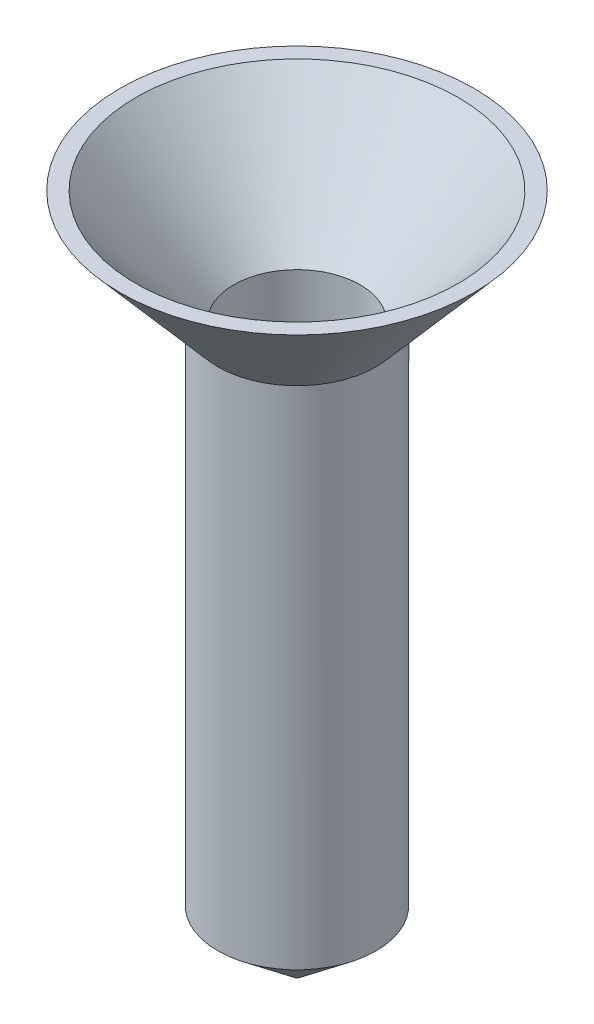
ISO-10303-21;
HEADER;
FILE_DESCRIPTION(('STEP AP214'),'2;1');
FILE_NAME('part.step','',(''),(''),'','','');
FILE_SCHEMA(('AUTOMOTIVE_DESIGN { 1 0 10303 214 1 1 1 1 }'));
ENDSEC;
DATA;
#1=APPLICATION_CONTEXT('core data for automotive mechanical design processes');
#2=APPLICATION_PROTOCOL_DEFINITION('international standard','automotive_design',2000,#1);
#3=PRODUCT_CONTEXT('',#1,'mechanical');
#4=PRODUCT('Part','Part','',(#3));
#5=PRODUCT_RELATED_PRODUCT_CATEGORY('part','',(#4));
#6=PRODUCT_DEFINITION_FORMATION('','',#4);
#7=PRODUCT_DEFINITION_CONTEXT('part definition',#1,'design');
#8=PRODUCT_DEFINITION('design','',#6,#7);
#9=PRODUCT_DEFINITION_SHAPE('','',#8);
#10=(LENGTH_UNIT() NAMED_UNIT(*) SI_UNIT(.MILLI.,.METRE.));
#11=(NAMED_UNIT(*) PLANE_ANGLE_UNIT() SI_UNIT($,.RADIAN.));
#12=(NAMED_UNIT(*) SI_UNIT($,.STERADIAN.) SOLID_ANGLE_UNIT());
#13=UNCERTAINTY_MEASURE_WITH_UNIT(LENGTH_MEASURE(1.E-05),#10,'distance_accuracy_value','');
#14=(GEOMETRIC_REPRESENTATION_CONTEXT(3) GLOBAL_UNCERTAINTY_ASSIGNED_CONTEXT((#13)) GLOBAL_UNIT_ASSIGNED_CONTEXT((#10,
#11,#12)) REPRESENTATION_CONTEXT('',''));
#15=CARTESIAN_POINT('',(0.,0.,0.));
#16=DIRECTION('',(0.,0.,1.));
#17=DIRECTION('',(1.,0.,0.));
#18=AXIS2_PLACEMENT_3D('',#15,#16,#17);
#19=CARTESIAN_POINT('',(0.,-254.,0.));
#20=DIRECTION('',(0.,1.,0.));
#21=DIRECTION('',(0.,0.,1.));
#22=AXIS2_PLACEMENT_3D('',#19,#20,#21);
#23=CYLINDRICAL_SURFACE('',#22,31.75);
#24=CARTESIAN_POINT('',(0.,0.,0.));
#25=DIRECTION('',(0.,1.,0.));
#26=DIRECTION('',(0.,0.,1.));
#27=AXIS2_PLACEMENT_3D('',#24,#25,#26);
#28=CIRCLE('',#27,31.75);
#29=CARTESIAN_POINT('',(0.,0.,31.75));
#30=VERTEX_POINT('',#29);
#31=EDGE_CURVE('E10',#30,#30,#28,.T.);
#32=ORIENTED_EDGE('',*,*,#31,.F.);
#33=EDGE_LOOP('',(#32));
#34=FACE_BOUND('',#33,.T.);
#35=CARTESIAN_POINT('',(0.,-203.2,0.));
#36=DIRECTION('',(0.,-1.,0.));
#37=DIRECTION('',(0.,0.,-1.));
#38=AXIS2_PLACEMENT_3D('',#35,#36,#37);
#39=CIRCLE('',#38,31.75);
#40=CARTESIAN_POINT('',(0.,-203.2,-31.75));
#41=VERTEX_POINT('',#40);
#42=EDGE_CURVE('E61',#41,#41,#39,.T.);
#43=ORIENTED_EDGE('',*,*,#42,.F.);
#44=EDGE_LOOP('',(#43));
#45=FACE_BOUND('',#44,.T.);
#46=ADVANCED_FACE('F42',(#34,#45),#23,.T.);
#47=CARTESIAN_POINT('',(0.,-254.,0.));
#48=DIRECTION('',(0.,1.,0.));
#49=DIRECTION('',(0.,0.,1.));
#50=AXIS2_PLACEMENT_3D('',#47,#48,#49);
#51=CYLINDRICAL_SURFACE('',#50,25.4);
#52=CARTESIAN_POINT('',(0.,0.,0.));
#53=DIRECTION('',(0.,-1.,0.));
#54=DIRECTION('',(0.,0.,-1.));
#55=AXIS2_PLACEMENT_3D('',#52,#53,#54);
#56=CIRCLE('',#55,25.4);
#57=CARTESIAN_POINT('',(0.,0.,-25.4));
#58=VERTEX_POINT('',#57);
#59=EDGE_CURVE('E49',#58,#58,#56,.T.);
#60=ORIENTED_EDGE('',*,*,#59,.F.);
#61=EDGE_LOOP('',(#60));
#62=FACE_BOUND('',#61,.T.);
#63=CARTESIAN_POINT('',(0.,-203.2,0.));
#64=DIRECTION('',(0.,-1.,0.));
#65=DIRECTION('',(0.,0.,-1.));
#66=AXIS2_PLACEMENT_3D('',#63,#64,#65);
#67=CIRCLE('',#66,25.4);
#68=CARTESIAN_POINT('',(0.,-203.2,-25.4));
#69=VERTEX_POINT('',#68);
#70=EDGE_CURVE('E45',#69,#69,#67,.F.);
#71=ORIENTED_EDGE('',*,*,#70,.F.);
#72=EDGE_LOOP('',(#71));
#73=FACE_BOUND('',#72,.T.);
#74=ADVANCED_FACE('F82',(#62,#73),#51,.F.);
#75=CARTESIAN_POINT('',(0.,45.4884262756372,0.));
#76=DIRECTION('',(0.,1.,0.));
#77=DIRECTION('',(0.,0.,1.));
#78=AXIS2_PLACEMENT_3D('',#75,#76,#77);
#79=CONICAL_SURFACE('',#78,64.7430540883446,0.713082369018691);
#80=ORIENTED_EDGE('',*,*,#59,.T.);
#81=EDGE_LOOP('',(#80));
#82=FACE_BOUND('',#81,.T.);
#83=CARTESIAN_POINT('',(0.,45.4884262756372,0.));
#84=DIRECTION('',(0.,-1.,0.));
#85=DIRECTION('',(0.,0.,-1.));
#86=AXIS2_PLACEMENT_3D('',#83,#84,#85);
#87=CIRCLE('',#86,64.7430540883446);
#88=CARTESIAN_POINT('',(0.,45.4884262756372,-64.7430540883446));
#89=VERTEX_POINT('',#88);
#90=EDGE_CURVE('E53',#89,#89,#87,.T.);
#91=ORIENTED_EDGE('',*,*,#90,.F.);
#92=EDGE_LOOP('',(#91));
#93=FACE_BOUND('',#92,.T.);
#94=ADVANCED_FACE('F87',(#82,#93),#79,.F.);
#95=CARTESIAN_POINT('',(0.,45.4884262756372,-64.7430540883446));
#96=DIRECTION('',(0.,1.,0.));
#97=DIRECTION('',(0.,0.,1.));
#98=AXIS2_PLACEMENT_3D('',#95,#96,#97);
#99=PLANE('',#98);
#100=ORIENTED_EDGE('',*,*,#90,.T.);
#101=EDGE_LOOP('',(#100));
#102=FACE_BOUND('',#101,.T.);
#103=CARTESIAN_POINT('',(0.,45.4884262756372,0.));
#104=DIRECTION('',(0.,-1.,0.));
#105=DIRECTION('',(0.,0.,-1.));
#106=AXIS2_PLACEMENT_3D('',#103,#104,#105);
#107=CIRCLE('',#106,71.0930540883445);
#108=CARTESIAN_POINT('',(0.,45.4884262756372,-71.0930540883445));
#109=VERTEX_POINT('',#108);
#110=EDGE_CURVE('E58',#109,#109,#107,.T.);
#111=ORIENTED_EDGE('',*,*,#110,.F.);
#112=EDGE_LOOP('',(#111));
#113=FACE_BOUND('',#112,.T.);
#114=ADVANCED_FACE('F92',(#102,#113),#99,.T.);
#115=CARTESIAN_POINT('',(0.,0.,0.));
#116=DIRECTION('',(0.,1.,0.));
#117=DIRECTION('',(0.,0.,1.));
#118=AXIS2_PLACEMENT_3D('',#115,#116,#117);
#119=CONICAL_SURFACE('',#118,31.75,0.713082369018691);
#120=ORIENTED_EDGE('',*,*,#110,.T.);
#121=EDGE_LOOP('',(#120));
#122=FACE_BOUND('',#121,.T.);
#123=ORIENTED_EDGE('',*,*,#31,.T.);
#124=EDGE_LOOP('',(#123));
#125=FACE_BOUND('',#124,.T.);
#126=ADVANCED_FACE('F77',(#122,#125),#119,.T.);
#127=CARTESIAN_POINT('',(0.,-203.2,0.));
#128=DIRECTION('',(0.,1.,0.));
#129=DIRECTION('',(0.,0.,1.));
#130=AXIS2_PLACEMENT_3D('',#127,#128,#129);
#131=CONICAL_SURFACE('',#130,31.75,0.896055384571344);
#132=CARTESIAN_POINT('',(0.,-227.518627334581,0.));
#133=DIRECTION('',(0.,-1.,0.));
#134=DIRECTION('',(0.,0.,-1.));
#135=AXIS2_PLACEMENT_3D('',#132,#133,#134);
#136=CIRCLE('',#135,1.35171583177323);
#137=CARTESIAN_POINT('',(0.,-227.518627334581,-1.35171583177323));
#138=VERTEX_POINT('',#137);
#139=EDGE_CURVE('E67',#138,#138,#136,.T.);
#140=ORIENTED_EDGE('',*,*,#139,.F.);
#141=EDGE_LOOP('',(#140));
#142=FACE_BOUND('',#141,.T.);
#143=ORIENTED_EDGE('',*,*,#42,.T.);
#144=EDGE_LOOP('',(#143));
#145=FACE_BOUND('',#144,.T.);
#146=ADVANCED_FACE('F73',(#142,#145),#131,.T.);
#147=CARTESIAN_POINT('',(0.,-225.226857466857,0.));
#148=DIRECTION('',(0.,1.,0.));
#149=DIRECTION('',(0.,0.,1.));
#150=AXIS2_PLACEMENT_3D('',#147,#148,#149);
#151=CONICAL_SURFACE('',#150,0.675857915886612,0.843028969350665);
#152=ORIENTED_EDGE('',*,*,#70,.T.);
#153=EDGE_LOOP('',(#152));
#154=FACE_BOUND('',#153,.T.);
#155=CARTESIAN_POINT('',(0.,-225.226857466857,0.));
#156=DIRECTION('',(0.,-1.,0.));
#157=DIRECTION('',(0.,0.,-1.));
#158=AXIS2_PLACEMENT_3D('',#155,#156,#157);
#159=CIRCLE('',#158,0.675857915886612);
#160=CARTESIAN_POINT('',(0.,-225.226857466857,-0.675857915886612));
#161=VERTEX_POINT('',#160);
#162=EDGE_CURVE('E64',#161,#161,#159,.T.);
#163=ORIENTED_EDGE('',*,*,#162,.T.);
#164=EDGE_LOOP('',(#163));
#165=FACE_BOUND('',#164,.T.);
#166=ADVANCED_FACE('F76',(#154,#165),#151,.F.);
#167=CARTESIAN_POINT('',(0.,-227.518627334581,0.));
#168=DIRECTION('',(0.,-1.,0.));
#169=DIRECTION('',(0.,0.,-1.));
#170=AXIS2_PLACEMENT_3D('',#167,#168,#169);
#171=CONICAL_SURFACE('',#170,1.35171583177323,0.286777367037621);
#172=ORIENTED_EDGE('',*,*,#162,.F.);
#173=EDGE_LOOP('',(#172));
#174=FACE_BOUND('',#173,.T.);
#175=ORIENTED_EDGE('',*,*,#139,.T.);
#176=EDGE_LOOP('',(#175));
#177=FACE_BOUND('',#176,.T.);
#178=ADVANCED_FACE('F71',(#174,#177),#171,.F.);
#179=CLOSED_SHELL('',(#46,#74,#94,#114,#126,#146,#166,#178));
#180=MANIFOLD_SOLID_BREP('B2',#179);
#181=ADVANCED_BREP_SHAPE_REPRESENTATION('',(#18,#180),#14);
#182=SHAPE_DEFINITION_REPRESENTATION(#9,#181);
ENDSEC;
END-ISO-10303-21;
